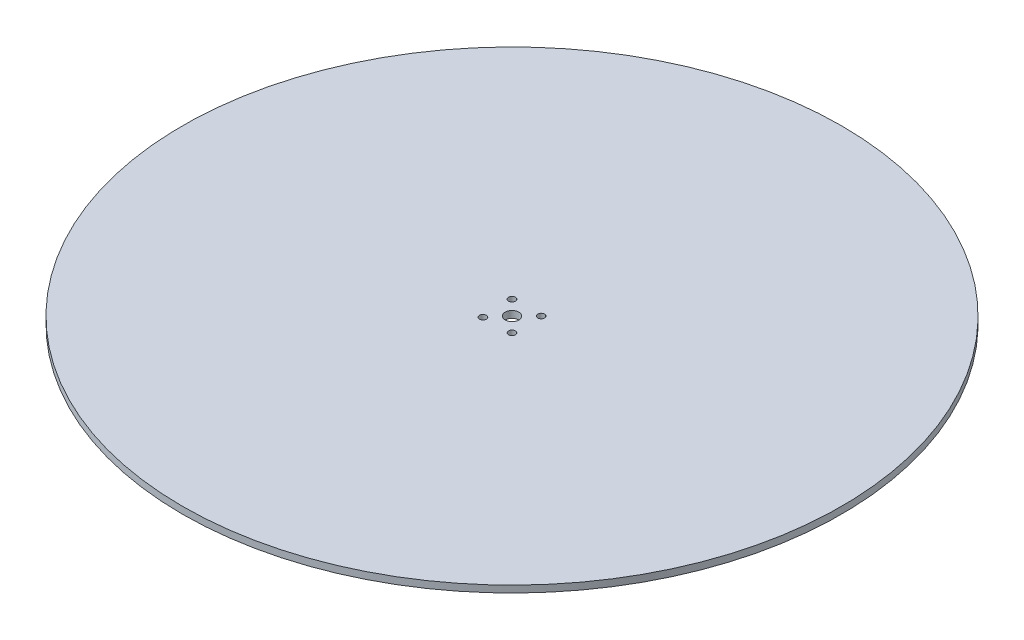
ISO-10303-21;
HEADER;
FILE_DESCRIPTION(('STEP AP214'),'2;1');
FILE_NAME('part.step','',(''),(''),'','','');
FILE_SCHEMA(('AUTOMOTIVE_DESIGN { 1 0 10303 214 1 1 1 1 }'));
ENDSEC;
DATA;
#1=APPLICATION_CONTEXT('core data for automotive mechanical design processes');
#2=APPLICATION_PROTOCOL_DEFINITION('international standard','automotive_design',2000,#1);
#3=PRODUCT_CONTEXT('',#1,'mechanical');
#4=PRODUCT('Part','Part','',(#3));
#5=PRODUCT_RELATED_PRODUCT_CATEGORY('part','',(#4));
#6=PRODUCT_DEFINITION_FORMATION('','',#4);
#7=PRODUCT_DEFINITION_CONTEXT('part definition',#1,'design');
#8=PRODUCT_DEFINITION('design','',#6,#7);
#9=PRODUCT_DEFINITION_SHAPE('','',#8);
#10=(LENGTH_UNIT() NAMED_UNIT(*) SI_UNIT(.MILLI.,.METRE.));
#11=(NAMED_UNIT(*) PLANE_ANGLE_UNIT() SI_UNIT($,.RADIAN.));
#12=(NAMED_UNIT(*) SI_UNIT($,.STERADIAN.) SOLID_ANGLE_UNIT());
#13=UNCERTAINTY_MEASURE_WITH_UNIT(LENGTH_MEASURE(1.E-05),#10,'distance_accuracy_value','');
#14=(GEOMETRIC_REPRESENTATION_CONTEXT(3) GLOBAL_UNCERTAINTY_ASSIGNED_CONTEXT((#13)) GLOBAL_UNIT_ASSIGNED_CONTEXT((#10,
#11,#12)) REPRESENTATION_CONTEXT('',''));
#15=CARTESIAN_POINT('',(0.,0.,0.));
#16=DIRECTION('',(0.,0.,1.));
#17=DIRECTION('',(1.,0.,0.));
#18=AXIS2_PLACEMENT_3D('',#15,#16,#17);
#19=CARTESIAN_POINT('',(0.,3.175,0.));
#20=DIRECTION('',(0.,-1.,0.));
#21=DIRECTION('',(0.,0.,-1.));
#22=AXIS2_PLACEMENT_3D('',#19,#20,#21);
#23=CYLINDRICAL_SURFACE('',#22,152.4);
#24=CARTESIAN_POINT('',(0.,3.175,0.));
#25=DIRECTION('',(0.,1.,0.));
#26=DIRECTION('',(0.,0.,1.));
#27=AXIS2_PLACEMENT_3D('',#24,#25,#26);
#28=CIRCLE('',#27,152.4);
#29=CARTESIAN_POINT('',(0.,3.175,152.4));
#30=VERTEX_POINT('',#29);
#31=EDGE_CURVE('E10',#30,#30,#28,.T.);
#32=ORIENTED_EDGE('',*,*,#31,.F.);
#33=EDGE_LOOP('',(#32));
#34=FACE_BOUND('',#33,.T.);
#35=CARTESIAN_POINT('',(0.,0.,0.));
#36=DIRECTION('',(0.,1.,0.));
#37=DIRECTION('',(0.,0.,1.));
#38=AXIS2_PLACEMENT_3D('',#35,#36,#37);
#39=CIRCLE('',#38,152.4);
#40=CARTESIAN_POINT('',(0.,0.,152.4));
#41=VERTEX_POINT('',#40);
#42=EDGE_CURVE('E37',#41,#41,#39,.T.);
#43=ORIENTED_EDGE('',*,*,#42,.T.);
#44=EDGE_LOOP('',(#43));
#45=FACE_BOUND('',#44,.T.);
#46=ADVANCED_FACE('F34',(#34,#45),#23,.T.);
#47=CARTESIAN_POINT('',(0.,3.175,0.));
#48=DIRECTION('',(0.,1.,0.));
#49=DIRECTION('',(0.,0.,1.));
#50=AXIS2_PLACEMENT_3D('',#47,#48,#49);
#51=PLANE('',#50);
#52=CARTESIAN_POINT('',(6.73519209080187,3.175,6.73519209080187));
#53=DIRECTION('',(0.,1.,0.));
#54=DIRECTION('',(0.,0.,1.));
#55=AXIS2_PLACEMENT_3D('',#52,#53,#54);
#56=CIRCLE('',#55,1.5875);
#57=CARTESIAN_POINT('',(6.73519209080187,3.175,8.32269209080187));
#58=VERTEX_POINT('',#57);
#59=EDGE_CURVE('E56',#58,#58,#56,.T.);
#60=ORIENTED_EDGE('',*,*,#59,.F.);
#61=EDGE_LOOP('',(#60));
#62=FACE_BOUND('',#61,.T.);
#63=CARTESIAN_POINT('',(-6.24015016331852,3.175,7.19625951027587));
#64=DIRECTION('',(0.,1.,0.));
#65=DIRECTION('',(0.,0.,1.));
#66=AXIS2_PLACEMENT_3D('',#63,#64,#65);
#67=CIRCLE('',#66,1.5875);
#68=CARTESIAN_POINT('',(-6.24015016331852,3.175,8.78375951027587));
#69=VERTEX_POINT('',#68);
#70=EDGE_CURVE('E55',#69,#69,#67,.T.);
#71=ORIENTED_EDGE('',*,*,#70,.F.);
#72=EDGE_LOOP('',(#71));
#73=FACE_BOUND('',#72,.T.);
#74=CARTESIAN_POINT('',(-6.73519209080187,3.175,-6.73519209080187));
#75=DIRECTION('',(0.,1.,0.));
#76=DIRECTION('',(0.,0.,1.));
#77=AXIS2_PLACEMENT_3D('',#74,#75,#76);
#78=CIRCLE('',#77,1.5875);
#79=CARTESIAN_POINT('',(-6.73519209080187,3.175,-5.14769209080186));
#80=VERTEX_POINT('',#79);
#81=EDGE_CURVE('E62',#80,#80,#78,.T.);
#82=ORIENTED_EDGE('',*,*,#81,.F.);
#83=EDGE_LOOP('',(#82));
#84=FACE_BOUND('',#83,.T.);
#85=CARTESIAN_POINT('',(6.73519209080187,3.175,-6.73519209080187));
#86=DIRECTION('',(0.,1.,0.));
#87=DIRECTION('',(0.,0.,1.));
#88=AXIS2_PLACEMENT_3D('',#85,#86,#87);
#89=CIRCLE('',#88,1.5875);
#90=CARTESIAN_POINT('',(6.73519209080187,3.175,-5.14769209080186));
#91=VERTEX_POINT('',#90);
#92=EDGE_CURVE('E68',#91,#91,#89,.T.);
#93=ORIENTED_EDGE('',*,*,#92,.F.);
#94=EDGE_LOOP('',(#93));
#95=FACE_BOUND('',#94,.T.);
#96=CARTESIAN_POINT('',(0.,3.175,0.));
#97=DIRECTION('',(0.,1.,0.));
#98=DIRECTION('',(0.,0.,1.));
#99=AXIS2_PLACEMENT_3D('',#96,#97,#98);
#100=CIRCLE('',#99,3.175);
#101=CARTESIAN_POINT('',(0.,3.175,3.175));
#102=VERTEX_POINT('',#101);
#103=EDGE_CURVE('E48',#102,#102,#100,.T.);
#104=ORIENTED_EDGE('',*,*,#103,.F.);
#105=EDGE_LOOP('',(#104));
#106=FACE_BOUND('',#105,.T.);
#107=ORIENTED_EDGE('',*,*,#31,.T.);
#108=EDGE_LOOP('',(#107));
#109=FACE_BOUND('',#108,.T.);
#110=ADVANCED_FACE('F79',(#62,#73,#84,#95,#106,#109),#51,.T.);
#111=CARTESIAN_POINT('',(0.,0.,0.));
#112=DIRECTION('',(0.,1.,0.));
#113=DIRECTION('',(0.,0.,1.));
#114=AXIS2_PLACEMENT_3D('',#111,#112,#113);
#115=PLANE('',#114);
#116=CARTESIAN_POINT('',(6.73519209080187,0.,6.73519209080187));
#117=DIRECTION('',(0.,1.,0.));
#118=DIRECTION('',(0.,0.,1.));
#119=AXIS2_PLACEMENT_3D('',#116,#117,#118);
#120=CIRCLE('',#119,1.5875);
#121=CARTESIAN_POINT('',(6.73519209080187,0.,8.32269209080187));
#122=VERTEX_POINT('',#121);
#123=EDGE_CURVE('E52',#122,#122,#120,.F.);
#124=ORIENTED_EDGE('',*,*,#123,.F.);
#125=EDGE_LOOP('',(#124));
#126=FACE_BOUND('',#125,.T.);
#127=CARTESIAN_POINT('',(-6.24015016331852,0.,7.19625951027587));
#128=DIRECTION('',(0.,1.,0.));
#129=DIRECTION('',(0.,0.,1.));
#130=AXIS2_PLACEMENT_3D('',#127,#128,#129);
#131=CIRCLE('',#130,1.5875);
#132=CARTESIAN_POINT('',(-6.24015016331852,0.,8.78375951027587));
#133=VERTEX_POINT('',#132);
#134=EDGE_CURVE('E59',#133,#133,#131,.F.);
#135=ORIENTED_EDGE('',*,*,#134,.F.);
#136=EDGE_LOOP('',(#135));
#137=FACE_BOUND('',#136,.T.);
#138=CARTESIAN_POINT('',(-6.73519209080187,0.,-6.73519209080187));
#139=DIRECTION('',(0.,1.,0.));
#140=DIRECTION('',(0.,0.,1.));
#141=AXIS2_PLACEMENT_3D('',#138,#139,#140);
#142=CIRCLE('',#141,1.5875);
#143=CARTESIAN_POINT('',(-6.73519209080187,0.,-5.14769209080186));
#144=VERTEX_POINT('',#143);
#145=EDGE_CURVE('E65',#144,#144,#142,.F.);
#146=ORIENTED_EDGE('',*,*,#145,.F.);
#147=EDGE_LOOP('',(#146));
#148=FACE_BOUND('',#147,.T.);
#149=CARTESIAN_POINT('',(6.73519209080187,0.,-6.73519209080187));
#150=DIRECTION('',(0.,1.,0.));
#151=DIRECTION('',(0.,0.,1.));
#152=AXIS2_PLACEMENT_3D('',#149,#150,#151);
#153=CIRCLE('',#152,1.5875);
#154=CARTESIAN_POINT('',(6.73519209080187,0.,-5.14769209080186));
#155=VERTEX_POINT('',#154);
#156=EDGE_CURVE('E51',#155,#155,#153,.F.);
#157=ORIENTED_EDGE('',*,*,#156,.F.);
#158=EDGE_LOOP('',(#157));
#159=FACE_BOUND('',#158,.T.);
#160=CARTESIAN_POINT('',(0.,0.,0.));
#161=DIRECTION('',(0.,1.,0.));
#162=DIRECTION('',(0.,0.,1.));
#163=AXIS2_PLACEMENT_3D('',#160,#161,#162);
#164=CIRCLE('',#163,3.175);
#165=CARTESIAN_POINT('',(0.,0.,3.175));
#166=VERTEX_POINT('',#165);
#167=EDGE_CURVE('E44',#166,#166,#164,.F.);
#168=ORIENTED_EDGE('',*,*,#167,.F.);
#169=EDGE_LOOP('',(#168));
#170=FACE_BOUND('',#169,.T.);
#171=ORIENTED_EDGE('',*,*,#42,.F.);
#172=EDGE_LOOP('',(#171));
#173=FACE_BOUND('',#172,.T.);
#174=ADVANCED_FACE('F82',(#126,#137,#148,#159,#170,#173),#115,.F.);
#175=CARTESIAN_POINT('',(0.,-0.00100000000000013,0.));
#176=DIRECTION('',(0.,1.,0.));
#177=DIRECTION('',(0.,0.,1.));
#178=AXIS2_PLACEMENT_3D('',#175,#176,#177);
#179=CYLINDRICAL_SURFACE('',#178,3.175);
#180=ORIENTED_EDGE('',*,*,#103,.T.);
#181=EDGE_LOOP('',(#180));
#182=FACE_BOUND('',#181,.T.);
#183=ORIENTED_EDGE('',*,*,#167,.T.);
#184=EDGE_LOOP('',(#183));
#185=FACE_BOUND('',#184,.T.);
#186=ADVANCED_FACE('F87',(#182,#185),#179,.F.);
#187=CARTESIAN_POINT('',(6.73519209080187,-0.00100000000000013,-6.73519209080187));
#188=DIRECTION('',(0.,1.,0.));
#189=DIRECTION('',(0.,0.,1.));
#190=AXIS2_PLACEMENT_3D('',#187,#188,#189);
#191=CYLINDRICAL_SURFACE('',#190,1.5875);
#192=ORIENTED_EDGE('',*,*,#92,.T.);
#193=EDGE_LOOP('',(#192));
#194=FACE_BOUND('',#193,.T.);
#195=ORIENTED_EDGE('',*,*,#156,.T.);
#196=EDGE_LOOP('',(#195));
#197=FACE_BOUND('',#196,.T.);
#198=ADVANCED_FACE('F76',(#194,#197),#191,.F.);
#199=CARTESIAN_POINT('',(-6.73519209080187,-0.00100000000000013,-6.73519209080187));
#200=DIRECTION('',(0.,1.,0.));
#201=DIRECTION('',(0.,0.,1.));
#202=AXIS2_PLACEMENT_3D('',#199,#200,#201);
#203=CYLINDRICAL_SURFACE('',#202,1.5875);
#204=ORIENTED_EDGE('',*,*,#81,.T.);
#205=EDGE_LOOP('',(#204));
#206=FACE_BOUND('',#205,.T.);
#207=ORIENTED_EDGE('',*,*,#145,.T.);
#208=EDGE_LOOP('',(#207));
#209=FACE_BOUND('',#208,.T.);
#210=ADVANCED_FACE('F125',(#206,#209),#203,.F.);
#211=CARTESIAN_POINT('',(-6.24015016331852,-0.00100000000000013,7.19625951027587));
#212=DIRECTION('',(0.,1.,0.));
#213=DIRECTION('',(0.,0.,1.));
#214=AXIS2_PLACEMENT_3D('',#211,#212,#213);
#215=CYLINDRICAL_SURFACE('',#214,1.5875);
#216=ORIENTED_EDGE('',*,*,#70,.T.);
#217=EDGE_LOOP('',(#216));
#218=FACE_BOUND('',#217,.T.);
#219=ORIENTED_EDGE('',*,*,#134,.T.);
#220=EDGE_LOOP('',(#219));
#221=FACE_BOUND('',#220,.T.);
#222=ADVANCED_FACE('F132',(#218,#221),#215,.F.);
#223=CARTESIAN_POINT('',(6.73519209080187,-0.00100000000000013,6.73519209080187));
#224=DIRECTION('',(0.,1.,0.));
#225=DIRECTION('',(0.,0.,1.));
#226=AXIS2_PLACEMENT_3D('',#223,#224,#225);
#227=CYLINDRICAL_SURFACE('',#226,1.5875);
#228=ORIENTED_EDGE('',*,*,#59,.T.);
#229=EDGE_LOOP('',(#228));
#230=FACE_BOUND('',#229,.T.);
#231=ORIENTED_EDGE('',*,*,#123,.T.);
#232=EDGE_LOOP('',(#231));
#233=FACE_BOUND('',#232,.T.);
#234=ADVANCED_FACE('F140',(#230,#233),#227,.F.);
#235=CLOSED_SHELL('',(#46,#110,#174,#186,#198,#210,#222,#234));
#236=MANIFOLD_SOLID_BREP('B2',#235);
#237=ADVANCED_BREP_SHAPE_REPRESENTATION('',(#18,#236),#14);
#238=SHAPE_DEFINITION_REPRESENTATION(#9,#237);
ENDSEC;
END-ISO-10303-21;
